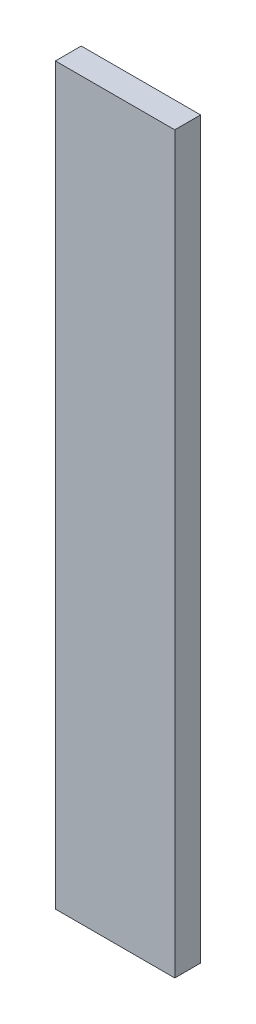
ISO-10303-21;
HEADER;
FILE_DESCRIPTION(('STEP AP214'),'2;1');
FILE_NAME('part.step','',(''),(''),'','','');
FILE_SCHEMA(('AUTOMOTIVE_DESIGN { 1 0 10303 214 1 1 1 1 }'));
ENDSEC;
DATA;
#1=APPLICATION_CONTEXT('core data for automotive mechanical design processes');
#2=APPLICATION_PROTOCOL_DEFINITION('international standard','automotive_design',2000,#1);
#3=PRODUCT_CONTEXT('',#1,'mechanical');
#4=PRODUCT('Part','Part','',(#3));
#5=PRODUCT_RELATED_PRODUCT_CATEGORY('part','',(#4));
#6=PRODUCT_DEFINITION_FORMATION('','',#4);
#7=PRODUCT_DEFINITION_CONTEXT('part definition',#1,'design');
#8=PRODUCT_DEFINITION('design','',#6,#7);
#9=PRODUCT_DEFINITION_SHAPE('','',#8);
#10=(LENGTH_UNIT() NAMED_UNIT(*) SI_UNIT(.MILLI.,.METRE.));
#11=(NAMED_UNIT(*) PLANE_ANGLE_UNIT() SI_UNIT($,.RADIAN.));
#12=(NAMED_UNIT(*) SI_UNIT($,.STERADIAN.) SOLID_ANGLE_UNIT());
#13=UNCERTAINTY_MEASURE_WITH_UNIT(LENGTH_MEASURE(1.E-05),#10,'distance_accuracy_value','');
#14=(GEOMETRIC_REPRESENTATION_CONTEXT(3) GLOBAL_UNCERTAINTY_ASSIGNED_CONTEXT((#13)) GLOBAL_UNIT_ASSIGNED_CONTEXT((#10,
#11,#12)) REPRESENTATION_CONTEXT('',''));
#15=CARTESIAN_POINT('',(0.,0.,0.));
#16=DIRECTION('',(0.,0.,1.));
#17=DIRECTION('',(1.,0.,0.));
#18=AXIS2_PLACEMENT_3D('',#15,#16,#17);
#19=CARTESIAN_POINT('',(-0.485000000000013,-2.985,0.));
#20=DIRECTION('',(0.,0.,1.));
#21=DIRECTION('',(1.,0.,0.));
#22=AXIS2_PLACEMENT_3D('',#19,#20,#21);
#23=PLANE('',#22);
#24=DIRECTION('',(1.,0.,0.));
#25=VECTOR('',#24,1.);
#26=CARTESIAN_POINT('',(-0.485000000000013,2.985,0.));
#27=LINE('',#26,#25);
#28=CARTESIAN_POINT('',(0.485000000000013,2.985,0.));
#29=VERTEX_POINT('',#28);
#30=CARTESIAN_POINT('',(-0.485000000000013,2.985,0.));
#31=VERTEX_POINT('',#30);
#32=EDGE_CURVE('E20',#29,#31,#27,.F.);
#33=ORIENTED_EDGE('',*,*,#32,.F.);
#34=DIRECTION('',(0.,-1.,0.));
#35=VECTOR('',#34,1.);
#36=CARTESIAN_POINT('',(0.485000000000013,2.985,0.));
#37=LINE('',#36,#35);
#38=CARTESIAN_POINT('',(0.485000000000013,-2.985,0.));
#39=VERTEX_POINT('',#38);
#40=EDGE_CURVE('E71',#29,#39,#37,.T.);
#41=ORIENTED_EDGE('',*,*,#40,.T.);
#42=DIRECTION('',(-1.,0.,0.));
#43=VECTOR('',#42,1.);
#44=CARTESIAN_POINT('',(-0.485000000000013,-2.985,0.));
#45=LINE('',#44,#43);
#46=CARTESIAN_POINT('',(-0.485000000000013,-2.985,0.));
#47=VERTEX_POINT('',#46);
#48=EDGE_CURVE('E57',#39,#47,#45,.T.);
#49=ORIENTED_EDGE('',*,*,#48,.T.);
#50=DIRECTION('',(0.,1.,0.));
#51=VECTOR('',#50,1.);
#52=CARTESIAN_POINT('',(-0.485000000000013,2.985,0.));
#53=LINE('',#52,#51);
#54=EDGE_CURVE('E63',#47,#31,#53,.T.);
#55=ORIENTED_EDGE('',*,*,#54,.T.);
#56=EDGE_LOOP('',(#33,#41,#49,#55));
#57=FACE_BOUND('',#56,.T.);
#58=ADVANCED_FACE('F17',(#57),#23,.F.);
#59=CARTESIAN_POINT('',(-0.485000000000013,2.985,0.209999999999988));
#60=DIRECTION('',(1.,0.,0.));
#61=DIRECTION('',(0.,1.,0.));
#62=AXIS2_PLACEMENT_3D('',#59,#60,#61);
#63=PLANE('',#62);
#64=DIRECTION('',(0.,0.,1.));
#65=VECTOR('',#64,1.);
#66=CARTESIAN_POINT('',(-0.485000000000013,-2.985,0.209999999999988));
#67=LINE('',#66,#65);
#68=CARTESIAN_POINT('',(-0.485000000000013,-2.985,0.209999999999988));
#69=VERTEX_POINT('',#68);
#70=EDGE_CURVE('E65',#47,#69,#67,.T.);
#71=ORIENTED_EDGE('',*,*,#70,.T.);
#72=DIRECTION('',(0.,1.,0.));
#73=VECTOR('',#72,1.);
#74=CARTESIAN_POINT('',(-0.485000000000013,-2.985,0.209999999999988));
#75=LINE('',#74,#73);
#76=CARTESIAN_POINT('',(-0.485000000000013,2.985,0.209999999999988));
#77=VERTEX_POINT('',#76);
#78=EDGE_CURVE('E93',#77,#69,#75,.F.);
#79=ORIENTED_EDGE('',*,*,#78,.F.);
#80=DIRECTION('',(0.,0.,1.));
#81=VECTOR('',#80,1.);
#82=CARTESIAN_POINT('',(-0.485000000000013,2.985,0.209999999999988));
#83=LINE('',#82,#81);
#84=EDGE_CURVE('E68',#77,#31,#83,.F.);
#85=ORIENTED_EDGE('',*,*,#84,.T.);
#86=ORIENTED_EDGE('',*,*,#54,.F.);
#87=EDGE_LOOP('',(#71,#79,#85,#86));
#88=FACE_BOUND('',#87,.T.);
#89=ADVANCED_FACE('F64',(#88),#63,.F.);
#90=CARTESIAN_POINT('',(-0.485000000000013,-2.985,0.209999999999988));
#91=DIRECTION('',(0.,1.,0.));
#92=DIRECTION('',(-1.,0.,0.));
#93=AXIS2_PLACEMENT_3D('',#90,#91,#92);
#94=PLANE('',#93);
#95=DIRECTION('',(0.,0.,1.));
#96=VECTOR('',#95,1.);
#97=CARTESIAN_POINT('',(0.485000000000014,-2.985,0.209999999999988));
#98=LINE('',#97,#96);
#99=CARTESIAN_POINT('',(0.485000000000013,-2.985,0.209999999999988));
#100=VERTEX_POINT('',#99);
#101=EDGE_CURVE('E74',#39,#100,#98,.T.);
#102=ORIENTED_EDGE('',*,*,#101,.T.);
#103=DIRECTION('',(1.,0.,0.));
#104=VECTOR('',#103,1.);
#105=CARTESIAN_POINT('',(-0.485000000000013,-2.985,0.209999999999988));
#106=LINE('',#105,#104);
#107=EDGE_CURVE('E78',#69,#100,#106,.T.);
#108=ORIENTED_EDGE('',*,*,#107,.F.);
#109=ORIENTED_EDGE('',*,*,#70,.F.);
#110=ORIENTED_EDGE('',*,*,#48,.F.);
#111=EDGE_LOOP('',(#102,#108,#109,#110));
#112=FACE_BOUND('',#111,.T.);
#113=ADVANCED_FACE('F76',(#112),#94,.F.);
#114=CARTESIAN_POINT('',(0.485000000000013,2.985,0.209999999999988));
#115=DIRECTION('',(-1.,0.,0.));
#116=DIRECTION('',(0.,-1.,0.));
#117=AXIS2_PLACEMENT_3D('',#114,#115,#116);
#118=PLANE('',#117);
#119=DIRECTION('',(0.,0.,1.));
#120=VECTOR('',#119,1.);
#121=CARTESIAN_POINT('',(0.485000000000013,2.985,0.209999999999988));
#122=LINE('',#121,#120);
#123=CARTESIAN_POINT('',(0.485000000000013,2.985,0.209999999999988));
#124=VERTEX_POINT('',#123);
#125=EDGE_CURVE('E36',#29,#124,#122,.T.);
#126=ORIENTED_EDGE('',*,*,#125,.T.);
#127=DIRECTION('',(0.,1.,0.));
#128=VECTOR('',#127,1.);
#129=CARTESIAN_POINT('',(0.485000000000013,-2.985,0.209999999999988));
#130=LINE('',#129,#128);
#131=EDGE_CURVE('E27',#100,#124,#130,.T.);
#132=ORIENTED_EDGE('',*,*,#131,.F.);
#133=ORIENTED_EDGE('',*,*,#101,.F.);
#134=ORIENTED_EDGE('',*,*,#40,.F.);
#135=EDGE_LOOP('',(#126,#132,#133,#134));
#136=FACE_BOUND('',#135,.T.);
#137=ADVANCED_FACE('F102',(#136),#118,.F.);
#138=CARTESIAN_POINT('',(-0.485000000000013,2.985,0.209999999999988));
#139=DIRECTION('',(0.,-1.,0.));
#140=DIRECTION('',(1.,0.,0.));
#141=AXIS2_PLACEMENT_3D('',#138,#139,#140);
#142=PLANE('',#141);
#143=ORIENTED_EDGE('',*,*,#84,.F.);
#144=DIRECTION('',(1.,0.,0.));
#145=VECTOR('',#144,1.);
#146=CARTESIAN_POINT('',(-0.485000000000013,2.985,0.209999999999988));
#147=LINE('',#146,#145);
#148=EDGE_CURVE('E11',#124,#77,#147,.F.);
#149=ORIENTED_EDGE('',*,*,#148,.F.);
#150=ORIENTED_EDGE('',*,*,#125,.F.);
#151=ORIENTED_EDGE('',*,*,#32,.T.);
#152=EDGE_LOOP('',(#143,#149,#150,#151));
#153=FACE_BOUND('',#152,.T.);
#154=ADVANCED_FACE('F104',(#153),#142,.F.);
#155=CARTESIAN_POINT('',(-0.485000000000013,-2.985,0.209999999999988));
#156=DIRECTION('',(0.,0.,1.));
#157=DIRECTION('',(1.,0.,0.));
#158=AXIS2_PLACEMENT_3D('',#155,#156,#157);
#159=PLANE('',#158);
#160=ORIENTED_EDGE('',*,*,#131,.T.);
#161=ORIENTED_EDGE('',*,*,#148,.T.);
#162=ORIENTED_EDGE('',*,*,#78,.T.);
#163=ORIENTED_EDGE('',*,*,#107,.T.);
#164=EDGE_LOOP('',(#160,#161,#162,#163));
#165=FACE_BOUND('',#164,.T.);
#166=ADVANCED_FACE('F101',(#165),#159,.T.);
#167=CLOSED_SHELL('',(#58,#89,#113,#137,#154,#166));
#168=MANIFOLD_SOLID_BREP('B1',#167);
#169=ADVANCED_BREP_SHAPE_REPRESENTATION('',(#18,#168),#14);
#170=SHAPE_DEFINITION_REPRESENTATION(#9,#169);
ENDSEC;
END-ISO-10303-21;
